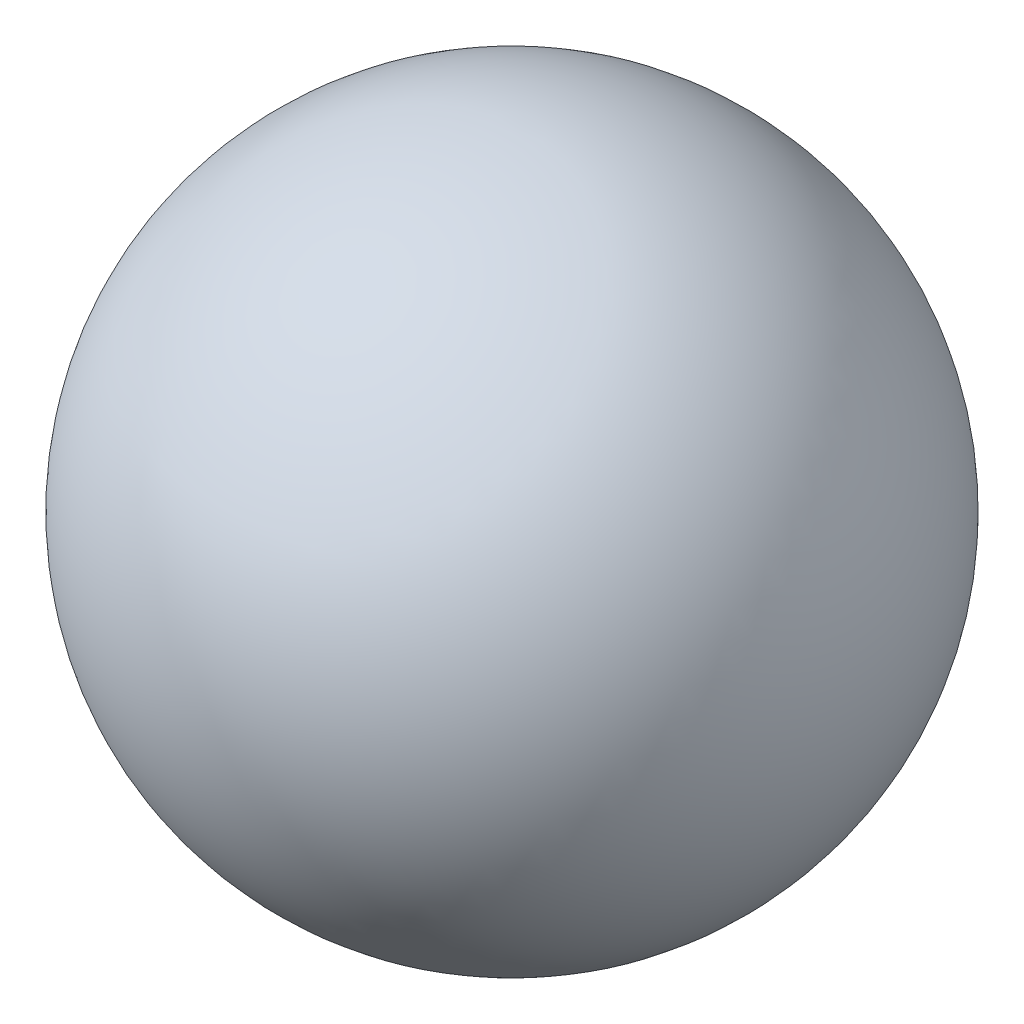
ISO-10303-21;
HEADER;
FILE_DESCRIPTION(('STEP AP214'),'2;1');
FILE_NAME('part.step','',(''),(''),'','','');
FILE_SCHEMA(('AUTOMOTIVE_DESIGN { 1 0 10303 214 1 1 1 1 }'));
ENDSEC;
DATA;
#1=APPLICATION_CONTEXT('core data for automotive mechanical design processes');
#2=APPLICATION_PROTOCOL_DEFINITION('international standard','automotive_design',2000,#1);
#3=PRODUCT_CONTEXT('',#1,'mechanical');
#4=PRODUCT('Part','Part','',(#3));
#5=PRODUCT_RELATED_PRODUCT_CATEGORY('part','',(#4));
#6=PRODUCT_DEFINITION_FORMATION('','',#4);
#7=PRODUCT_DEFINITION_CONTEXT('part definition',#1,'design');
#8=PRODUCT_DEFINITION('design','',#6,#7);
#9=PRODUCT_DEFINITION_SHAPE('','',#8);
#10=(LENGTH_UNIT() NAMED_UNIT(*) SI_UNIT(.MILLI.,.METRE.));
#11=(NAMED_UNIT(*) PLANE_ANGLE_UNIT() SI_UNIT($,.RADIAN.));
#12=(NAMED_UNIT(*) SI_UNIT($,.STERADIAN.) SOLID_ANGLE_UNIT());
#13=UNCERTAINTY_MEASURE_WITH_UNIT(LENGTH_MEASURE(1.E-05),#10,'distance_accuracy_value','');
#14=(GEOMETRIC_REPRESENTATION_CONTEXT(3) GLOBAL_UNCERTAINTY_ASSIGNED_CONTEXT((#13)) GLOBAL_UNIT_ASSIGNED_CONTEXT((#10,
#11,#12)) REPRESENTATION_CONTEXT('',''));
#15=CARTESIAN_POINT('',(0.,0.,0.));
#16=DIRECTION('',(0.,0.,1.));
#17=DIRECTION('',(1.,0.,0.));
#18=AXIS2_PLACEMENT_3D('',#15,#16,#17);
#19=CARTESIAN_POINT('',(-0.7065039653113,0.,3.095396121177));
#20=DIRECTION('',(0.,-1.,0.));
#21=DIRECTION('',(-0.974927912181826,0.,-0.222520933956306));
#22=AXIS2_PLACEMENT_3D('',#19,#20,#21);
#23=SPHERICAL_SURFACE('',#22,0.794);
#24=CARTESIAN_POINT('',(-0.7065039653113,-0.794,3.095396121177));
#25=VERTEX_POINT('',#24);
#26=VERTEX_LOOP('',#25);
#27=FACE_BOUND('',#26,.T.);
#28=ADVANCED_FACE('F12',(#27),#23,.T.);
#29=CLOSED_SHELL('',(#28));
#30=MANIFOLD_SOLID_BREP('B1',#29);
#31=ADVANCED_BREP_SHAPE_REPRESENTATION('',(#18,#30),#14);
#32=SHAPE_DEFINITION_REPRESENTATION(#9,#31);
ENDSEC;
END-ISO-10303-21;
